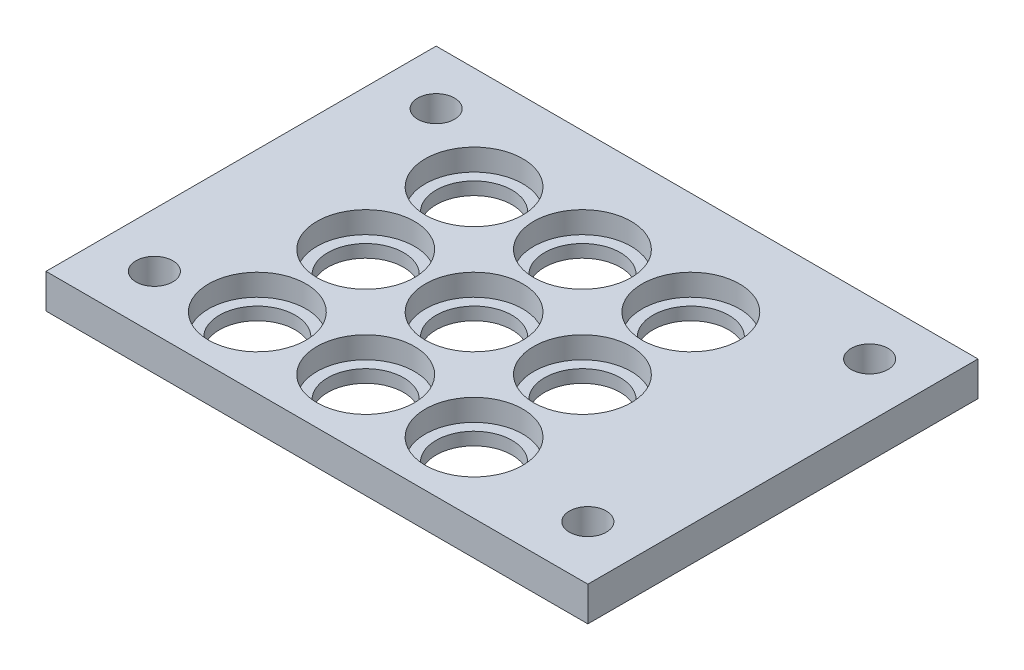
ISO-10303-21;
HEADER;
FILE_DESCRIPTION(('STEP AP214'),'2;1');
FILE_NAME('part.step','',(''),(''),'','','');
FILE_SCHEMA(('AUTOMOTIVE_DESIGN { 1 0 10303 214 1 1 1 1 }'));
ENDSEC;
DATA;
#1=APPLICATION_CONTEXT('core data for automotive mechanical design processes');
#2=APPLICATION_PROTOCOL_DEFINITION('international standard','automotive_design',2000,#1);
#3=PRODUCT_CONTEXT('',#1,'mechanical');
#4=PRODUCT('Part','Part','',(#3));
#5=PRODUCT_RELATED_PRODUCT_CATEGORY('part','',(#4));
#6=PRODUCT_DEFINITION_FORMATION('','',#4);
#7=PRODUCT_DEFINITION_CONTEXT('part definition',#1,'design');
#8=PRODUCT_DEFINITION('design','',#6,#7);
#9=PRODUCT_DEFINITION_SHAPE('','',#8);
#10=(LENGTH_UNIT() NAMED_UNIT(*) SI_UNIT(.MILLI.,.METRE.));
#11=(NAMED_UNIT(*) PLANE_ANGLE_UNIT() SI_UNIT($,.RADIAN.));
#12=(NAMED_UNIT(*) SI_UNIT($,.STERADIAN.) SOLID_ANGLE_UNIT());
#13=UNCERTAINTY_MEASURE_WITH_UNIT(LENGTH_MEASURE(1.E-05),#10,'distance_accuracy_value','');
#14=(GEOMETRIC_REPRESENTATION_CONTEXT(3) GLOBAL_UNCERTAINTY_ASSIGNED_CONTEXT((#13)) GLOBAL_UNIT_ASSIGNED_CONTEXT((#10,
#11,#12)) REPRESENTATION_CONTEXT('',''));
#15=CARTESIAN_POINT('',(0.,0.,0.));
#16=DIRECTION('',(0.,0.,1.));
#17=DIRECTION('',(1.,0.,0.));
#18=AXIS2_PLACEMENT_3D('',#15,#16,#17);
#19=CARTESIAN_POINT('',(13.,3.175,-6.5));
#20=DIRECTION('',(0.,-1.,0.));
#21=DIRECTION('',(0.,0.,-1.));
#22=AXIS2_PLACEMENT_3D('',#19,#20,#21);
#23=CYLINDRICAL_SURFACE('',#22,3.5);
#24=CARTESIAN_POINT('',(13.,0.,-6.5));
#25=DIRECTION('',(0.,1.,0.));
#26=DIRECTION('',(0.,0.,1.));
#27=AXIS2_PLACEMENT_3D('',#24,#25,#26);
#28=CIRCLE('',#27,3.5);
#29=CARTESIAN_POINT('',(13.,0.,-3.));
#30=VERTEX_POINT('',#29);
#31=EDGE_CURVE('E168',#30,#30,#28,.T.);
#32=ORIENTED_EDGE('',*,*,#31,.F.);
#33=EDGE_LOOP('',(#32));
#34=FACE_BOUND('',#33,.T.);
#35=CARTESIAN_POINT('',(13.,1.175,-6.5));
#36=DIRECTION('',(0.,1.,0.));
#37=DIRECTION('',(0.,0.,1.));
#38=AXIS2_PLACEMENT_3D('',#35,#36,#37);
#39=CIRCLE('',#38,3.5);
#40=CARTESIAN_POINT('',(13.,1.175,-3.));
#41=VERTEX_POINT('',#40);
#42=EDGE_CURVE('E52',#41,#41,#39,.T.);
#43=ORIENTED_EDGE('',*,*,#42,.T.);
#44=EDGE_LOOP('',(#43));
#45=FACE_BOUND('',#44,.T.);
#46=ADVANCED_FACE('F48',(#34,#45),#23,.F.);
#47=CARTESIAN_POINT('',(23.,3.175,-6.5));
#48=DIRECTION('',(0.,-1.,0.));
#49=DIRECTION('',(0.,0.,-1.));
#50=AXIS2_PLACEMENT_3D('',#47,#48,#49);
#51=CYLINDRICAL_SURFACE('',#50,3.5);
#52=CARTESIAN_POINT('',(23.,0.,-6.5));
#53=DIRECTION('',(0.,1.,0.));
#54=DIRECTION('',(0.,0.,1.));
#55=AXIS2_PLACEMENT_3D('',#52,#53,#54);
#56=CIRCLE('',#55,3.5);
#57=CARTESIAN_POINT('',(23.,0.,-3.));
#58=VERTEX_POINT('',#57);
#59=EDGE_CURVE('E148',#58,#58,#56,.T.);
#60=ORIENTED_EDGE('',*,*,#59,.F.);
#61=EDGE_LOOP('',(#60));
#62=FACE_BOUND('',#61,.T.);
#63=CARTESIAN_POINT('',(23.,1.175,-6.5));
#64=DIRECTION('',(0.,1.,0.));
#65=DIRECTION('',(0.,0.,1.));
#66=AXIS2_PLACEMENT_3D('',#63,#64,#65);
#67=CIRCLE('',#66,3.5);
#68=CARTESIAN_POINT('',(23.,1.175,-3.));
#69=VERTEX_POINT('',#68);
#70=EDGE_CURVE('E217',#69,#69,#67,.T.);
#71=ORIENTED_EDGE('',*,*,#70,.T.);
#72=EDGE_LOOP('',(#71));
#73=FACE_BOUND('',#72,.T.);
#74=ADVANCED_FACE('F326',(#62,#73),#51,.F.);
#75=CARTESIAN_POINT('',(33.,3.175,-6.5));
#76=DIRECTION('',(0.,-1.,0.));
#77=DIRECTION('',(0.,0.,-1.));
#78=AXIS2_PLACEMENT_3D('',#75,#76,#77);
#79=CYLINDRICAL_SURFACE('',#78,3.5);
#80=CARTESIAN_POINT('',(33.,0.,-6.5));
#81=DIRECTION('',(0.,1.,0.));
#82=DIRECTION('',(0.,0.,1.));
#83=AXIS2_PLACEMENT_3D('',#80,#81,#82);
#84=CIRCLE('',#83,3.5);
#85=CARTESIAN_POINT('',(33.,0.,-3.));
#86=VERTEX_POINT('',#85);
#87=EDGE_CURVE('E144',#86,#86,#84,.T.);
#88=ORIENTED_EDGE('',*,*,#87,.F.);
#89=EDGE_LOOP('',(#88));
#90=FACE_BOUND('',#89,.T.);
#91=CARTESIAN_POINT('',(33.,1.175,-6.5));
#92=DIRECTION('',(0.,1.,0.));
#93=DIRECTION('',(0.,0.,1.));
#94=AXIS2_PLACEMENT_3D('',#91,#92,#93);
#95=CIRCLE('',#94,3.5);
#96=CARTESIAN_POINT('',(33.,1.175,-3.));
#97=VERTEX_POINT('',#96);
#98=EDGE_CURVE('E214',#97,#97,#95,.T.);
#99=ORIENTED_EDGE('',*,*,#98,.T.);
#100=EDGE_LOOP('',(#99));
#101=FACE_BOUND('',#100,.T.);
#102=ADVANCED_FACE('F332',(#90,#101),#79,.F.);
#103=CARTESIAN_POINT('',(23.,3.175,-16.5));
#104=DIRECTION('',(0.,-1.,0.));
#105=DIRECTION('',(0.,0.,-1.));
#106=AXIS2_PLACEMENT_3D('',#103,#104,#105);
#107=CYLINDRICAL_SURFACE('',#106,3.5);
#108=CARTESIAN_POINT('',(23.,0.,-16.5));
#109=DIRECTION('',(0.,1.,0.));
#110=DIRECTION('',(0.,0.,1.));
#111=AXIS2_PLACEMENT_3D('',#108,#109,#110);
#112=CIRCLE('',#111,3.5);
#113=CARTESIAN_POINT('',(23.,0.,-13.));
#114=VERTEX_POINT('',#113);
#115=EDGE_CURVE('E140',#114,#114,#112,.T.);
#116=ORIENTED_EDGE('',*,*,#115,.F.);
#117=EDGE_LOOP('',(#116));
#118=FACE_BOUND('',#117,.T.);
#119=CARTESIAN_POINT('',(23.,1.175,-16.5));
#120=DIRECTION('',(0.,1.,0.));
#121=DIRECTION('',(0.,0.,1.));
#122=AXIS2_PLACEMENT_3D('',#119,#120,#121);
#123=CIRCLE('',#122,3.5);
#124=CARTESIAN_POINT('',(23.,1.175,-13.));
#125=VERTEX_POINT('',#124);
#126=EDGE_CURVE('E210',#125,#125,#123,.T.);
#127=ORIENTED_EDGE('',*,*,#126,.T.);
#128=EDGE_LOOP('',(#127));
#129=FACE_BOUND('',#128,.T.);
#130=ADVANCED_FACE('F355',(#118,#129),#107,.F.);
#131=CARTESIAN_POINT('',(33.,3.175,-16.5));
#132=DIRECTION('',(0.,-1.,0.));
#133=DIRECTION('',(0.,0.,-1.));
#134=AXIS2_PLACEMENT_3D('',#131,#132,#133);
#135=CYLINDRICAL_SURFACE('',#134,3.5);
#136=CARTESIAN_POINT('',(33.,0.,-16.5));
#137=DIRECTION('',(0.,1.,0.));
#138=DIRECTION('',(0.,0.,1.));
#139=AXIS2_PLACEMENT_3D('',#136,#137,#138);
#140=CIRCLE('',#139,3.5);
#141=CARTESIAN_POINT('',(33.,0.,-13.));
#142=VERTEX_POINT('',#141);
#143=EDGE_CURVE('E136',#142,#142,#140,.T.);
#144=ORIENTED_EDGE('',*,*,#143,.F.);
#145=EDGE_LOOP('',(#144));
#146=FACE_BOUND('',#145,.T.);
#147=CARTESIAN_POINT('',(33.,1.175,-16.5));
#148=DIRECTION('',(0.,1.,0.));
#149=DIRECTION('',(0.,0.,1.));
#150=AXIS2_PLACEMENT_3D('',#147,#148,#149);
#151=CIRCLE('',#150,3.5);
#152=CARTESIAN_POINT('',(33.,1.175,-13.));
#153=VERTEX_POINT('',#152);
#154=EDGE_CURVE('E206',#153,#153,#151,.T.);
#155=ORIENTED_EDGE('',*,*,#154,.T.);
#156=EDGE_LOOP('',(#155));
#157=FACE_BOUND('',#156,.T.);
#158=ADVANCED_FACE('F359',(#146,#157),#135,.F.);
#159=CARTESIAN_POINT('',(22.9999999999999,3.175,-26.5));
#160=DIRECTION('',(0.,-1.,0.));
#161=DIRECTION('',(0.,0.,-1.));
#162=AXIS2_PLACEMENT_3D('',#159,#160,#161);
#163=CYLINDRICAL_SURFACE('',#162,3.5);
#164=CARTESIAN_POINT('',(22.9999999999999,0.,-26.5));
#165=DIRECTION('',(0.,1.,0.));
#166=DIRECTION('',(0.,0.,1.));
#167=AXIS2_PLACEMENT_3D('',#164,#165,#166);
#168=CIRCLE('',#167,3.5);
#169=CARTESIAN_POINT('',(22.9999999999999,0.,-23.));
#170=VERTEX_POINT('',#169);
#171=EDGE_CURVE('E132',#170,#170,#168,.T.);
#172=ORIENTED_EDGE('',*,*,#171,.F.);
#173=EDGE_LOOP('',(#172));
#174=FACE_BOUND('',#173,.T.);
#175=CARTESIAN_POINT('',(22.9999999999999,1.175,-26.5));
#176=DIRECTION('',(0.,1.,0.));
#177=DIRECTION('',(0.,0.,1.));
#178=AXIS2_PLACEMENT_3D('',#175,#176,#177);
#179=CIRCLE('',#178,3.5);
#180=CARTESIAN_POINT('',(22.9999999999999,1.175,-23.));
#181=VERTEX_POINT('',#180);
#182=EDGE_CURVE('E202',#181,#181,#179,.T.);
#183=ORIENTED_EDGE('',*,*,#182,.T.);
#184=EDGE_LOOP('',(#183));
#185=FACE_BOUND('',#184,.T.);
#186=ADVANCED_FACE('F363',(#174,#185),#163,.F.);
#187=CARTESIAN_POINT('',(32.9999999999999,3.175,-26.5));
#188=DIRECTION('',(0.,-1.,0.));
#189=DIRECTION('',(0.,0.,-1.));
#190=AXIS2_PLACEMENT_3D('',#187,#188,#189);
#191=CYLINDRICAL_SURFACE('',#190,3.5);
#192=CARTESIAN_POINT('',(32.9999999999999,0.,-26.5));
#193=DIRECTION('',(0.,1.,0.));
#194=DIRECTION('',(0.,0.,1.));
#195=AXIS2_PLACEMENT_3D('',#192,#193,#194);
#196=CIRCLE('',#195,3.5);
#197=CARTESIAN_POINT('',(32.9999999999999,0.,-23.));
#198=VERTEX_POINT('',#197);
#199=EDGE_CURVE('E128',#198,#198,#196,.T.);
#200=ORIENTED_EDGE('',*,*,#199,.F.);
#201=EDGE_LOOP('',(#200));
#202=FACE_BOUND('',#201,.T.);
#203=CARTESIAN_POINT('',(32.9999999999999,1.175,-26.5));
#204=DIRECTION('',(0.,1.,0.));
#205=DIRECTION('',(0.,0.,1.));
#206=AXIS2_PLACEMENT_3D('',#203,#204,#205);
#207=CIRCLE('',#206,3.5);
#208=CARTESIAN_POINT('',(32.9999999999999,1.175,-23.));
#209=VERTEX_POINT('',#208);
#210=EDGE_CURVE('E198',#209,#209,#207,.T.);
#211=ORIENTED_EDGE('',*,*,#210,.T.);
#212=EDGE_LOOP('',(#211));
#213=FACE_BOUND('',#212,.T.);
#214=ADVANCED_FACE('F367',(#202,#213),#191,.F.);
#215=CARTESIAN_POINT('',(13.,3.175,-16.5));
#216=DIRECTION('',(0.,-1.,0.));
#217=DIRECTION('',(0.,0.,-1.));
#218=AXIS2_PLACEMENT_3D('',#215,#216,#217);
#219=CYLINDRICAL_SURFACE('',#218,3.5);
#220=CARTESIAN_POINT('',(13.,0.,-16.5));
#221=DIRECTION('',(0.,1.,0.));
#222=DIRECTION('',(0.,0.,1.));
#223=AXIS2_PLACEMENT_3D('',#220,#221,#222);
#224=CIRCLE('',#223,3.5);
#225=CARTESIAN_POINT('',(13.,0.,-13.));
#226=VERTEX_POINT('',#225);
#227=EDGE_CURVE('E124',#226,#226,#224,.T.);
#228=ORIENTED_EDGE('',*,*,#227,.F.);
#229=EDGE_LOOP('',(#228));
#230=FACE_BOUND('',#229,.T.);
#231=CARTESIAN_POINT('',(13.,1.175,-16.5));
#232=DIRECTION('',(0.,1.,0.));
#233=DIRECTION('',(0.,0.,1.));
#234=AXIS2_PLACEMENT_3D('',#231,#232,#233);
#235=CIRCLE('',#234,3.5);
#236=CARTESIAN_POINT('',(13.,1.175,-13.));
#237=VERTEX_POINT('',#236);
#238=EDGE_CURVE('E193',#237,#237,#235,.T.);
#239=ORIENTED_EDGE('',*,*,#238,.T.);
#240=EDGE_LOOP('',(#239));
#241=FACE_BOUND('',#240,.T.);
#242=ADVANCED_FACE('F370',(#230,#241),#219,.F.);
#243=CARTESIAN_POINT('',(12.9999999999999,3.175,-26.5));
#244=DIRECTION('',(0.,-1.,0.));
#245=DIRECTION('',(0.,0.,-1.));
#246=AXIS2_PLACEMENT_3D('',#243,#244,#245);
#247=CYLINDRICAL_SURFACE('',#246,3.5);
#248=CARTESIAN_POINT('',(12.9999999999999,0.,-26.5));
#249=DIRECTION('',(0.,1.,0.));
#250=DIRECTION('',(0.,0.,1.));
#251=AXIS2_PLACEMENT_3D('',#248,#249,#250);
#252=CIRCLE('',#251,3.5);
#253=CARTESIAN_POINT('',(12.9999999999999,0.,-23.));
#254=VERTEX_POINT('',#253);
#255=EDGE_CURVE('E120',#254,#254,#252,.T.);
#256=ORIENTED_EDGE('',*,*,#255,.F.);
#257=EDGE_LOOP('',(#256));
#258=FACE_BOUND('',#257,.T.);
#259=CARTESIAN_POINT('',(12.9999999999999,1.175,-26.5));
#260=DIRECTION('',(0.,1.,0.));
#261=DIRECTION('',(0.,0.,1.));
#262=AXIS2_PLACEMENT_3D('',#259,#260,#261);
#263=CIRCLE('',#262,3.5);
#264=CARTESIAN_POINT('',(12.9999999999999,1.175,-23.));
#265=VERTEX_POINT('',#264);
#266=EDGE_CURVE('E189',#265,#265,#263,.T.);
#267=ORIENTED_EDGE('',*,*,#266,.T.);
#268=EDGE_LOOP('',(#267));
#269=FACE_BOUND('',#268,.T.);
#270=ADVANCED_FACE('F50',(#258,#269),#247,.F.);
#271=CARTESIAN_POINT('',(0.,3.175,0.));
#272=DIRECTION('',(0.,0.,-1.));
#273=DIRECTION('',(-1.,0.,0.));
#274=AXIS2_PLACEMENT_3D('',#271,#272,#273);
#275=PLANE('',#274);
#276=DIRECTION('',(1.,0.,0.));
#277=VECTOR('',#276,1.);
#278=CARTESIAN_POINT('',(0.,0.,0.));
#279=LINE('',#278,#277);
#280=CARTESIAN_POINT('',(0.,0.,0.));
#281=VERTEX_POINT('',#280);
#282=CARTESIAN_POINT('',(50.,0.,0.));
#283=VERTEX_POINT('',#282);
#284=EDGE_CURVE('E172',#281,#283,#279,.T.);
#285=ORIENTED_EDGE('',*,*,#284,.T.);
#286=DIRECTION('',(0.,-1.,0.));
#287=VECTOR('',#286,1.);
#288=CARTESIAN_POINT('',(50.,3.175,0.));
#289=LINE('',#288,#287);
#290=CARTESIAN_POINT('',(50.,3.175,0.));
#291=VERTEX_POINT('',#290);
#292=EDGE_CURVE('E12',#291,#283,#289,.T.);
#293=ORIENTED_EDGE('',*,*,#292,.F.);
#294=DIRECTION('',(1.,0.,0.));
#295=VECTOR('',#294,1.);
#296=CARTESIAN_POINT('',(0.,3.175,0.));
#297=LINE('',#296,#295);
#298=CARTESIAN_POINT('',(0.,3.175,0.));
#299=VERTEX_POINT('',#298);
#300=EDGE_CURVE('E101',#299,#291,#297,.T.);
#301=ORIENTED_EDGE('',*,*,#300,.F.);
#302=DIRECTION('',(0.,-1.,0.));
#303=VECTOR('',#302,1.);
#304=CARTESIAN_POINT('',(0.,3.175,0.));
#305=LINE('',#304,#303);
#306=EDGE_CURVE('E68',#299,#281,#305,.T.);
#307=ORIENTED_EDGE('',*,*,#306,.T.);
#308=EDGE_LOOP('',(#285,#293,#301,#307));
#309=FACE_BOUND('',#308,.T.);
#310=ADVANCED_FACE('F338',(#309),#275,.F.);
#311=CARTESIAN_POINT('',(50.,3.175,0.));
#312=DIRECTION('',(-1.,0.,0.));
#313=DIRECTION('',(0.,0.,1.));
#314=AXIS2_PLACEMENT_3D('',#311,#312,#313);
#315=PLANE('',#314);
#316=DIRECTION('',(0.,0.,-1.));
#317=VECTOR('',#316,1.);
#318=CARTESIAN_POINT('',(50.,0.,0.));
#319=LINE('',#318,#317);
#320=CARTESIAN_POINT('',(50.,0.,-36.));
#321=VERTEX_POINT('',#320);
#322=EDGE_CURVE('E107',#283,#321,#319,.T.);
#323=ORIENTED_EDGE('',*,*,#322,.T.);
#324=DIRECTION('',(0.,-1.,0.));
#325=VECTOR('',#324,1.);
#326=CARTESIAN_POINT('',(50.,3.175,-36.));
#327=LINE('',#326,#325);
#328=CARTESIAN_POINT('',(50.,3.175,-36.));
#329=VERTEX_POINT('',#328);
#330=EDGE_CURVE('E59',#329,#321,#327,.T.);
#331=ORIENTED_EDGE('',*,*,#330,.F.);
#332=DIRECTION('',(0.,0.,-1.));
#333=VECTOR('',#332,1.);
#334=CARTESIAN_POINT('',(50.,3.175,0.));
#335=LINE('',#334,#333);
#336=EDGE_CURVE('E93',#291,#329,#335,.T.);
#337=ORIENTED_EDGE('',*,*,#336,.F.);
#338=ORIENTED_EDGE('',*,*,#292,.T.);
#339=EDGE_LOOP('',(#323,#331,#337,#338));
#340=FACE_BOUND('',#339,.T.);
#341=ADVANCED_FACE('F106',(#340),#315,.F.);
#342=CARTESIAN_POINT('',(0.,3.175,-36.));
#343=DIRECTION('',(0.,0.,-1.));
#344=DIRECTION('',(-1.,0.,0.));
#345=AXIS2_PLACEMENT_3D('',#342,#343,#344);
#346=PLANE('',#345);
#347=DIRECTION('',(1.,0.,0.));
#348=VECTOR('',#347,1.);
#349=CARTESIAN_POINT('',(0.,0.,-36.));
#350=LINE('',#349,#348);
#351=CARTESIAN_POINT('',(0.,0.,-36.));
#352=VERTEX_POINT('',#351);
#353=EDGE_CURVE('E177',#352,#321,#350,.T.);
#354=ORIENTED_EDGE('',*,*,#353,.F.);
#355=DIRECTION('',(0.,-1.,0.));
#356=VECTOR('',#355,1.);
#357=CARTESIAN_POINT('',(0.,3.175,-36.));
#358=LINE('',#357,#356);
#359=CARTESIAN_POINT('',(0.,3.175,-36.));
#360=VERTEX_POINT('',#359);
#361=EDGE_CURVE('E82',#360,#352,#358,.T.);
#362=ORIENTED_EDGE('',*,*,#361,.F.);
#363=DIRECTION('',(1.,0.,0.));
#364=VECTOR('',#363,1.);
#365=CARTESIAN_POINT('',(0.,3.175,-36.));
#366=LINE('',#365,#364);
#367=EDGE_CURVE('E100',#360,#329,#366,.T.);
#368=ORIENTED_EDGE('',*,*,#367,.T.);
#369=ORIENTED_EDGE('',*,*,#330,.T.);
#370=EDGE_LOOP('',(#354,#362,#368,#369));
#371=FACE_BOUND('',#370,.T.);
#372=ADVANCED_FACE('F112',(#371),#346,.T.);
#373=CARTESIAN_POINT('',(5.,3.175,-5.));
#374=DIRECTION('',(0.,-1.,0.));
#375=DIRECTION('',(0.,0.,-1.));
#376=AXIS2_PLACEMENT_3D('',#373,#374,#375);
#377=CYLINDRICAL_SURFACE('',#376,1.7);
#378=CARTESIAN_POINT('',(5.,3.175,-5.));
#379=DIRECTION('',(0.,1.,0.));
#380=DIRECTION('',(0.,0.,1.));
#381=AXIS2_PLACEMENT_3D('',#378,#379,#380);
#382=CIRCLE('',#381,1.7);
#383=CARTESIAN_POINT('',(5.,3.175,-3.3));
#384=VERTEX_POINT('',#383);
#385=EDGE_CURVE('E297',#384,#384,#382,.T.);
#386=ORIENTED_EDGE('',*,*,#385,.T.);
#387=EDGE_LOOP('',(#386));
#388=FACE_BOUND('',#387,.T.);
#389=CARTESIAN_POINT('',(5.,0.,-5.));
#390=DIRECTION('',(0.,1.,0.));
#391=DIRECTION('',(0.,0.,1.));
#392=AXIS2_PLACEMENT_3D('',#389,#390,#391);
#393=CIRCLE('',#392,1.7);
#394=CARTESIAN_POINT('',(5.,0.,-3.3));
#395=VERTEX_POINT('',#394);
#396=EDGE_CURVE('E164',#395,#395,#393,.T.);
#397=ORIENTED_EDGE('',*,*,#396,.F.);
#398=EDGE_LOOP('',(#397));
#399=FACE_BOUND('',#398,.T.);
#400=ADVANCED_FACE('F303',(#388,#399),#377,.F.);
#401=CARTESIAN_POINT('',(5.,3.175,-31.));
#402=DIRECTION('',(0.,-1.,0.));
#403=DIRECTION('',(0.,0.,-1.));
#404=AXIS2_PLACEMENT_3D('',#401,#402,#403);
#405=CYLINDRICAL_SURFACE('',#404,1.7);
#406=CARTESIAN_POINT('',(5.,3.175,-31.));
#407=DIRECTION('',(0.,1.,0.));
#408=DIRECTION('',(0.,0.,1.));
#409=AXIS2_PLACEMENT_3D('',#406,#407,#408);
#410=CIRCLE('',#409,1.7);
#411=CARTESIAN_POINT('',(5.,3.175,-29.3));
#412=VERTEX_POINT('',#411);
#413=EDGE_CURVE('E293',#412,#412,#410,.T.);
#414=ORIENTED_EDGE('',*,*,#413,.T.);
#415=EDGE_LOOP('',(#414));
#416=FACE_BOUND('',#415,.T.);
#417=CARTESIAN_POINT('',(5.,0.,-31.));
#418=DIRECTION('',(0.,1.,0.));
#419=DIRECTION('',(0.,0.,1.));
#420=AXIS2_PLACEMENT_3D('',#417,#418,#419);
#421=CIRCLE('',#420,1.7);
#422=CARTESIAN_POINT('',(5.,0.,-29.3));
#423=VERTEX_POINT('',#422);
#424=EDGE_CURVE('E160',#423,#423,#421,.T.);
#425=ORIENTED_EDGE('',*,*,#424,.F.);
#426=EDGE_LOOP('',(#425));
#427=FACE_BOUND('',#426,.T.);
#428=ADVANCED_FACE('F342',(#416,#427),#405,.F.);
#429=CARTESIAN_POINT('',(45.,3.175,-31.));
#430=DIRECTION('',(0.,-1.,0.));
#431=DIRECTION('',(0.,0.,-1.));
#432=AXIS2_PLACEMENT_3D('',#429,#430,#431);
#433=CYLINDRICAL_SURFACE('',#432,1.7);
#434=CARTESIAN_POINT('',(45.,3.175,-31.));
#435=DIRECTION('',(0.,1.,0.));
#436=DIRECTION('',(0.,0.,1.));
#437=AXIS2_PLACEMENT_3D('',#434,#435,#436);
#438=CIRCLE('',#437,1.7);
#439=CARTESIAN_POINT('',(45.,3.175,-29.3));
#440=VERTEX_POINT('',#439);
#441=EDGE_CURVE('E289',#440,#440,#438,.T.);
#442=ORIENTED_EDGE('',*,*,#441,.T.);
#443=EDGE_LOOP('',(#442));
#444=FACE_BOUND('',#443,.T.);
#445=CARTESIAN_POINT('',(45.,0.,-31.));
#446=DIRECTION('',(0.,1.,0.));
#447=DIRECTION('',(0.,0.,1.));
#448=AXIS2_PLACEMENT_3D('',#445,#446,#447);
#449=CIRCLE('',#448,1.7);
#450=CARTESIAN_POINT('',(45.,0.,-29.3));
#451=VERTEX_POINT('',#450);
#452=EDGE_CURVE('E156',#451,#451,#449,.T.);
#453=ORIENTED_EDGE('',*,*,#452,.F.);
#454=EDGE_LOOP('',(#453));
#455=FACE_BOUND('',#454,.T.);
#456=ADVANCED_FACE('F345',(#444,#455),#433,.F.);
#457=CARTESIAN_POINT('',(45.,3.175,-5.));
#458=DIRECTION('',(0.,-1.,0.));
#459=DIRECTION('',(0.,0.,-1.));
#460=AXIS2_PLACEMENT_3D('',#457,#458,#459);
#461=CYLINDRICAL_SURFACE('',#460,1.7);
#462=CARTESIAN_POINT('',(45.,3.175,-5.));
#463=DIRECTION('',(0.,1.,0.));
#464=DIRECTION('',(0.,0.,1.));
#465=AXIS2_PLACEMENT_3D('',#462,#463,#464);
#466=CIRCLE('',#465,1.7);
#467=CARTESIAN_POINT('',(45.,3.175,-3.3));
#468=VERTEX_POINT('',#467);
#469=EDGE_CURVE('E184',#468,#468,#466,.T.);
#470=ORIENTED_EDGE('',*,*,#469,.T.);
#471=EDGE_LOOP('',(#470));
#472=FACE_BOUND('',#471,.T.);
#473=CARTESIAN_POINT('',(45.,0.,-5.));
#474=DIRECTION('',(0.,1.,0.));
#475=DIRECTION('',(0.,0.,1.));
#476=AXIS2_PLACEMENT_3D('',#473,#474,#475);
#477=CIRCLE('',#476,1.7);
#478=CARTESIAN_POINT('',(45.,0.,-3.3));
#479=VERTEX_POINT('',#478);
#480=EDGE_CURVE('E152',#479,#479,#477,.T.);
#481=ORIENTED_EDGE('',*,*,#480,.F.);
#482=EDGE_LOOP('',(#481));
#483=FACE_BOUND('',#482,.T.);
#484=ADVANCED_FACE('F320',(#472,#483),#461,.F.);
#485=CARTESIAN_POINT('',(0.,3.175,0.));
#486=DIRECTION('',(-1.,0.,0.));
#487=DIRECTION('',(0.,0.,1.));
#488=AXIS2_PLACEMENT_3D('',#485,#486,#487);
#489=PLANE('',#488);
#490=DIRECTION('',(0.,0.,-1.));
#491=VECTOR('',#490,1.);
#492=CARTESIAN_POINT('',(0.,0.,0.));
#493=LINE('',#492,#491);
#494=EDGE_CURVE('E180',#281,#352,#493,.T.);
#495=ORIENTED_EDGE('',*,*,#494,.F.);
#496=ORIENTED_EDGE('',*,*,#306,.F.);
#497=DIRECTION('',(0.,0.,-1.));
#498=VECTOR('',#497,1.);
#499=CARTESIAN_POINT('',(0.,3.175,0.));
#500=LINE('',#499,#498);
#501=EDGE_CURVE('E114',#299,#360,#500,.T.);
#502=ORIENTED_EDGE('',*,*,#501,.T.);
#503=ORIENTED_EDGE('',*,*,#361,.T.);
#504=EDGE_LOOP('',(#495,#496,#502,#503));
#505=FACE_BOUND('',#504,.T.);
#506=ADVANCED_FACE('F308',(#505),#489,.T.);
#507=CARTESIAN_POINT('',(0.,3.175,0.));
#508=DIRECTION('',(0.,1.,0.));
#509=DIRECTION('',(0.,0.,1.));
#510=AXIS2_PLACEMENT_3D('',#507,#508,#509);
#511=PLANE('',#510);
#512=CARTESIAN_POINT('',(22.9999999999999,3.175,-26.5));
#513=DIRECTION('',(0.,1.,0.));
#514=DIRECTION('',(0.,0.,1.));
#515=AXIS2_PLACEMENT_3D('',#512,#513,#514);
#516=CIRCLE('',#515,4.5);
#517=CARTESIAN_POINT('',(22.9999999999999,3.175,-22.));
#518=VERTEX_POINT('',#517);
#519=EDGE_CURVE('E246',#518,#518,#516,.T.);
#520=ORIENTED_EDGE('',*,*,#519,.F.);
#521=EDGE_LOOP('',(#520));
#522=FACE_BOUND('',#521,.T.);
#523=CARTESIAN_POINT('',(32.9999999999999,3.175,-26.5));
#524=DIRECTION('',(0.,1.,0.));
#525=DIRECTION('',(0.,0.,1.));
#526=AXIS2_PLACEMENT_3D('',#523,#524,#525);
#527=CIRCLE('',#526,4.5);
#528=CARTESIAN_POINT('',(32.9999999999999,3.175,-22.));
#529=VERTEX_POINT('',#528);
#530=EDGE_CURVE('E255',#529,#529,#527,.T.);
#531=ORIENTED_EDGE('',*,*,#530,.F.);
#532=EDGE_LOOP('',(#531));
#533=FACE_BOUND('',#532,.T.);
#534=CARTESIAN_POINT('',(23.,3.175,-16.5));
#535=DIRECTION('',(0.,1.,0.));
#536=DIRECTION('',(0.,0.,1.));
#537=AXIS2_PLACEMENT_3D('',#534,#535,#536);
#538=CIRCLE('',#537,4.5);
#539=CARTESIAN_POINT('',(23.,3.175,-12.));
#540=VERTEX_POINT('',#539);
#541=EDGE_CURVE('E263',#540,#540,#538,.T.);
#542=ORIENTED_EDGE('',*,*,#541,.F.);
#543=EDGE_LOOP('',(#542));
#544=FACE_BOUND('',#543,.T.);
#545=CARTESIAN_POINT('',(33.,3.175,-16.5));
#546=DIRECTION('',(0.,1.,0.));
#547=DIRECTION('',(0.,0.,1.));
#548=AXIS2_PLACEMENT_3D('',#545,#546,#547);
#549=CIRCLE('',#548,4.5);
#550=CARTESIAN_POINT('',(33.,3.175,-12.));
#551=VERTEX_POINT('',#550);
#552=EDGE_CURVE('E271',#551,#551,#549,.T.);
#553=ORIENTED_EDGE('',*,*,#552,.F.);
#554=EDGE_LOOP('',(#553));
#555=FACE_BOUND('',#554,.T.);
#556=CARTESIAN_POINT('',(23.0000000000001,3.175,-6.49999999999999));
#557=DIRECTION('',(0.,1.,0.));
#558=DIRECTION('',(0.,0.,1.));
#559=AXIS2_PLACEMENT_3D('',#556,#557,#558);
#560=CIRCLE('',#559,4.5);
#561=CARTESIAN_POINT('',(23.0000000000001,3.175,-1.99999999999999));
#562=VERTEX_POINT('',#561);
#563=EDGE_CURVE('E279',#562,#562,#560,.T.);
#564=ORIENTED_EDGE('',*,*,#563,.F.);
#565=EDGE_LOOP('',(#564));
#566=FACE_BOUND('',#565,.T.);
#567=CARTESIAN_POINT('',(33.0000000000001,3.175,-6.49999999999999));
#568=DIRECTION('',(0.,1.,0.));
#569=DIRECTION('',(0.,0.,1.));
#570=AXIS2_PLACEMENT_3D('',#567,#568,#569);
#571=CIRCLE('',#570,4.5);
#572=CARTESIAN_POINT('',(33.0000000000001,3.175,-1.99999999999999));
#573=VERTEX_POINT('',#572);
#574=EDGE_CURVE('E399',#573,#573,#571,.T.);
#575=ORIENTED_EDGE('',*,*,#574,.F.);
#576=EDGE_LOOP('',(#575));
#577=FACE_BOUND('',#576,.T.);
#578=CARTESIAN_POINT('',(13.,3.175,-16.5));
#579=DIRECTION('',(0.,1.,0.));
#580=DIRECTION('',(0.,0.,1.));
#581=AXIS2_PLACEMENT_3D('',#578,#579,#580);
#582=CIRCLE('',#581,4.5);
#583=CARTESIAN_POINT('',(13.,3.175,-12.));
#584=VERTEX_POINT('',#583);
#585=EDGE_CURVE('E390',#584,#584,#582,.T.);
#586=ORIENTED_EDGE('',*,*,#585,.F.);
#587=EDGE_LOOP('',(#586));
#588=FACE_BOUND('',#587,.T.);
#589=CARTESIAN_POINT('',(13.0000000000001,3.175,-6.49999999999999));
#590=DIRECTION('',(0.,1.,0.));
#591=DIRECTION('',(0.,0.,1.));
#592=AXIS2_PLACEMENT_3D('',#589,#590,#591);
#593=CIRCLE('',#592,4.5);
#594=CARTESIAN_POINT('',(13.0000000000001,3.175,-1.99999999999999));
#595=VERTEX_POINT('',#594);
#596=EDGE_CURVE('E238',#595,#595,#593,.T.);
#597=ORIENTED_EDGE('',*,*,#596,.F.);
#598=EDGE_LOOP('',(#597));
#599=FACE_BOUND('',#598,.T.);
#600=CARTESIAN_POINT('',(12.9999999999999,3.175,-26.5));
#601=DIRECTION('',(0.,1.,0.));
#602=DIRECTION('',(0.,0.,1.));
#603=AXIS2_PLACEMENT_3D('',#600,#601,#602);
#604=CIRCLE('',#603,4.5);
#605=CARTESIAN_POINT('',(12.9999999999999,3.175,-22.));
#606=VERTEX_POINT('',#605);
#607=EDGE_CURVE('E250',#606,#606,#604,.T.);
#608=ORIENTED_EDGE('',*,*,#607,.F.);
#609=EDGE_LOOP('',(#608));
#610=FACE_BOUND('',#609,.T.);
#611=ORIENTED_EDGE('',*,*,#469,.F.);
#612=EDGE_LOOP('',(#611));
#613=FACE_BOUND('',#612,.T.);
#614=ORIENTED_EDGE('',*,*,#441,.F.);
#615=EDGE_LOOP('',(#614));
#616=FACE_BOUND('',#615,.T.);
#617=ORIENTED_EDGE('',*,*,#413,.F.);
#618=EDGE_LOOP('',(#617));
#619=FACE_BOUND('',#618,.T.);
#620=ORIENTED_EDGE('',*,*,#385,.F.);
#621=EDGE_LOOP('',(#620));
#622=FACE_BOUND('',#621,.T.);
#623=ORIENTED_EDGE('',*,*,#300,.T.);
#624=ORIENTED_EDGE('',*,*,#336,.T.);
#625=ORIENTED_EDGE('',*,*,#367,.F.);
#626=ORIENTED_EDGE('',*,*,#501,.F.);
#627=EDGE_LOOP('',(#623,#624,#625,#626));
#628=FACE_BOUND('',#627,.T.);
#629=ADVANCED_FACE('F97',(#522,#533,#544,#555,#566,#577,#588,#599,#610,#613,#616,#619,#622,
#628),#511,.T.);
#630=CARTESIAN_POINT('',(0.,0.,0.));
#631=DIRECTION('',(0.,1.,0.));
#632=DIRECTION('',(0.,0.,1.));
#633=AXIS2_PLACEMENT_3D('',#630,#631,#632);
#634=PLANE('',#633);
#635=ORIENTED_EDGE('',*,*,#255,.T.);
#636=EDGE_LOOP('',(#635));
#637=FACE_BOUND('',#636,.T.);
#638=ORIENTED_EDGE('',*,*,#227,.T.);
#639=EDGE_LOOP('',(#638));
#640=FACE_BOUND('',#639,.T.);
#641=ORIENTED_EDGE('',*,*,#199,.T.);
#642=EDGE_LOOP('',(#641));
#643=FACE_BOUND('',#642,.T.);
#644=ORIENTED_EDGE('',*,*,#171,.T.);
#645=EDGE_LOOP('',(#644));
#646=FACE_BOUND('',#645,.T.);
#647=ORIENTED_EDGE('',*,*,#143,.T.);
#648=EDGE_LOOP('',(#647));
#649=FACE_BOUND('',#648,.T.);
#650=ORIENTED_EDGE('',*,*,#115,.T.);
#651=EDGE_LOOP('',(#650));
#652=FACE_BOUND('',#651,.T.);
#653=ORIENTED_EDGE('',*,*,#87,.T.);
#654=EDGE_LOOP('',(#653));
#655=FACE_BOUND('',#654,.T.);
#656=ORIENTED_EDGE('',*,*,#59,.T.);
#657=EDGE_LOOP('',(#656));
#658=FACE_BOUND('',#657,.T.);
#659=ORIENTED_EDGE('',*,*,#480,.T.);
#660=EDGE_LOOP('',(#659));
#661=FACE_BOUND('',#660,.T.);
#662=ORIENTED_EDGE('',*,*,#452,.T.);
#663=EDGE_LOOP('',(#662));
#664=FACE_BOUND('',#663,.T.);
#665=ORIENTED_EDGE('',*,*,#424,.T.);
#666=EDGE_LOOP('',(#665));
#667=FACE_BOUND('',#666,.T.);
#668=ORIENTED_EDGE('',*,*,#396,.T.);
#669=EDGE_LOOP('',(#668));
#670=FACE_BOUND('',#669,.T.);
#671=ORIENTED_EDGE('',*,*,#31,.T.);
#672=EDGE_LOOP('',(#671));
#673=FACE_BOUND('',#672,.T.);
#674=ORIENTED_EDGE('',*,*,#284,.F.);
#675=ORIENTED_EDGE('',*,*,#494,.T.);
#676=ORIENTED_EDGE('',*,*,#353,.T.);
#677=ORIENTED_EDGE('',*,*,#322,.F.);
#678=EDGE_LOOP('',(#674,#675,#676,#677));
#679=FACE_BOUND('',#678,.T.);
#680=ADVANCED_FACE('F307',(#637,#640,#643,#646,#649,#652,#655,#658,#661,#664,#667,#670,#673,
#679),#634,.F.);
#681=CARTESIAN_POINT('',(12.9999999999999,1.175,-26.5));
#682=DIRECTION('',(0.,1.,0.));
#683=DIRECTION('',(0.,0.,1.));
#684=AXIS2_PLACEMENT_3D('',#681,#682,#683);
#685=CYLINDRICAL_SURFACE('',#684,4.5);
#686=CARTESIAN_POINT('',(12.9999999999999,1.175,-26.5));
#687=DIRECTION('',(0.,1.,0.));
#688=DIRECTION('',(0.,0.,1.));
#689=AXIS2_PLACEMENT_3D('',#686,#687,#688);
#690=CIRCLE('',#689,4.5);
#691=CARTESIAN_POINT('',(12.9999999999999,1.175,-22.));
#692=VERTEX_POINT('',#691);
#693=EDGE_CURVE('E194',#692,#692,#690,.T.);
#694=ORIENTED_EDGE('',*,*,#693,.F.);
#695=EDGE_LOOP('',(#694));
#696=FACE_BOUND('',#695,.T.);
#697=ORIENTED_EDGE('',*,*,#607,.T.);
#698=EDGE_LOOP('',(#697));
#699=FACE_BOUND('',#698,.T.);
#700=ADVANCED_FACE('F316',(#696,#699),#685,.F.);
#701=CARTESIAN_POINT('',(12.9999999999999,1.175,-26.5));
#702=DIRECTION('',(0.,1.,0.));
#703=DIRECTION('',(0.,0.,1.));
#704=AXIS2_PLACEMENT_3D('',#701,#702,#703);
#705=PLANE('',#704);
#706=ORIENTED_EDGE('',*,*,#266,.F.);
#707=EDGE_LOOP('',(#706));
#708=FACE_BOUND('',#707,.T.);
#709=ORIENTED_EDGE('',*,*,#693,.T.);
#710=EDGE_LOOP('',(#709));
#711=FACE_BOUND('',#710,.T.);
#712=ADVANCED_FACE('F529',(#708,#711),#705,.T.);
#713=CARTESIAN_POINT('',(13.0000000000001,1.175,-6.49999999999999));
#714=DIRECTION('',(0.,1.,0.));
#715=DIRECTION('',(0.,0.,1.));
#716=AXIS2_PLACEMENT_3D('',#713,#714,#715);
#717=CYLINDRICAL_SURFACE('',#716,4.5);
#718=CARTESIAN_POINT('',(13.0000000000001,1.175,-6.49999999999999));
#719=DIRECTION('',(0.,1.,0.));
#720=DIRECTION('',(0.,0.,1.));
#721=AXIS2_PLACEMENT_3D('',#718,#719,#720);
#722=CIRCLE('',#721,4.5);
#723=CARTESIAN_POINT('',(13.0000000000001,1.175,-1.99999999999999));
#724=VERTEX_POINT('',#723);
#725=EDGE_CURVE('E235',#724,#724,#722,.T.);
#726=ORIENTED_EDGE('',*,*,#725,.F.);
#727=EDGE_LOOP('',(#726));
#728=FACE_BOUND('',#727,.T.);
#729=ORIENTED_EDGE('',*,*,#596,.T.);
#730=EDGE_LOOP('',(#729));
#731=FACE_BOUND('',#730,.T.);
#732=ADVANCED_FACE('F231',(#728,#731),#717,.F.);
#733=CARTESIAN_POINT('',(13.0000000000001,1.175,-6.49999999999999));
#734=DIRECTION('',(0.,1.,0.));
#735=DIRECTION('',(0.,0.,1.));
#736=AXIS2_PLACEMENT_3D('',#733,#734,#735);
#737=PLANE('',#736);
#738=ORIENTED_EDGE('',*,*,#42,.F.);
#739=EDGE_LOOP('',(#738));
#740=FACE_BOUND('',#739,.T.);
#741=ORIENTED_EDGE('',*,*,#725,.T.);
#742=EDGE_LOOP('',(#741));
#743=FACE_BOUND('',#742,.T.);
#744=ADVANCED_FACE('F227',(#740,#743),#737,.T.);
#745=CARTESIAN_POINT('',(13.,1.175,-16.5));
#746=DIRECTION('',(0.,1.,0.));
#747=DIRECTION('',(0.,0.,1.));
#748=AXIS2_PLACEMENT_3D('',#745,#746,#747);
#749=CYLINDRICAL_SURFACE('',#748,4.5);
#750=CARTESIAN_POINT('',(13.,1.175,-16.5));
#751=DIRECTION('',(0.,1.,0.));
#752=DIRECTION('',(0.,0.,1.));
#753=AXIS2_PLACEMENT_3D('',#750,#751,#752);
#754=CIRCLE('',#753,4.5);
#755=CARTESIAN_POINT('',(13.,1.175,-12.));
#756=VERTEX_POINT('',#755);
#757=EDGE_CURVE('E242',#756,#756,#754,.T.);
#758=ORIENTED_EDGE('',*,*,#757,.F.);
#759=EDGE_LOOP('',(#758));
#760=FACE_BOUND('',#759,.T.);
#761=ORIENTED_EDGE('',*,*,#585,.T.);
#762=EDGE_LOOP('',(#761));
#763=FACE_BOUND('',#762,.T.);
#764=ADVANCED_FACE('F230',(#760,#763),#749,.F.);
#765=CARTESIAN_POINT('',(13.,1.175,-16.5));
#766=DIRECTION('',(0.,1.,0.));
#767=DIRECTION('',(0.,0.,1.));
#768=AXIS2_PLACEMENT_3D('',#765,#766,#767);
#769=PLANE('',#768);
#770=ORIENTED_EDGE('',*,*,#238,.F.);
#771=EDGE_LOOP('',(#770));
#772=FACE_BOUND('',#771,.T.);
#773=ORIENTED_EDGE('',*,*,#757,.T.);
#774=EDGE_LOOP('',(#773));
#775=FACE_BOUND('',#774,.T.);
#776=ADVANCED_FACE('F381',(#772,#775),#769,.T.);
#777=CARTESIAN_POINT('',(33.0000000000001,1.175,-6.49999999999999));
#778=DIRECTION('',(0.,1.,0.));
#779=DIRECTION('',(0.,0.,1.));
#780=AXIS2_PLACEMENT_3D('',#777,#778,#779);
#781=CYLINDRICAL_SURFACE('',#780,4.5);
#782=CARTESIAN_POINT('',(33.0000000000001,1.175,-6.49999999999999));
#783=DIRECTION('',(0.,1.,0.));
#784=DIRECTION('',(0.,0.,1.));
#785=AXIS2_PLACEMENT_3D('',#782,#783,#784);
#786=CIRCLE('',#785,4.5);
#787=CARTESIAN_POINT('',(33.0000000000001,1.175,-1.99999999999999));
#788=VERTEX_POINT('',#787);
#789=EDGE_CURVE('E393',#788,#788,#786,.T.);
#790=ORIENTED_EDGE('',*,*,#789,.F.);
#791=EDGE_LOOP('',(#790));
#792=FACE_BOUND('',#791,.T.);
#793=ORIENTED_EDGE('',*,*,#574,.T.);
#794=EDGE_LOOP('',(#793));
#795=FACE_BOUND('',#794,.T.);
#796=ADVANCED_FACE('F384',(#792,#795),#781,.F.);
#797=CARTESIAN_POINT('',(33.0000000000001,1.175,-6.49999999999999));
#798=DIRECTION('',(0.,1.,0.));
#799=DIRECTION('',(0.,0.,1.));
#800=AXIS2_PLACEMENT_3D('',#797,#798,#799);
#801=PLANE('',#800);
#802=ORIENTED_EDGE('',*,*,#98,.F.);
#803=EDGE_LOOP('',(#802));
#804=FACE_BOUND('',#803,.T.);
#805=ORIENTED_EDGE('',*,*,#789,.T.);
#806=EDGE_LOOP('',(#805));
#807=FACE_BOUND('',#806,.T.);
#808=ADVANCED_FACE('F575',(#804,#807),#801,.T.);
#809=CARTESIAN_POINT('',(23.0000000000001,1.175,-6.49999999999999));
#810=DIRECTION('',(0.,1.,0.));
#811=DIRECTION('',(0.,0.,1.));
#812=AXIS2_PLACEMENT_3D('',#809,#810,#811);
#813=CYLINDRICAL_SURFACE('',#812,4.5);
#814=CARTESIAN_POINT('',(23.0000000000001,1.175,-6.49999999999999));
#815=DIRECTION('',(0.,1.,0.));
#816=DIRECTION('',(0.,0.,1.));
#817=AXIS2_PLACEMENT_3D('',#814,#815,#816);
#818=CIRCLE('',#817,4.5);
#819=CARTESIAN_POINT('',(23.0000000000001,1.175,-1.99999999999999));
#820=VERTEX_POINT('',#819);
#821=EDGE_CURVE('E403',#820,#820,#818,.T.);
#822=ORIENTED_EDGE('',*,*,#821,.F.);
#823=EDGE_LOOP('',(#822));
#824=FACE_BOUND('',#823,.T.);
#825=ORIENTED_EDGE('',*,*,#563,.T.);
#826=EDGE_LOOP('',(#825));
#827=FACE_BOUND('',#826,.T.);
#828=ADVANCED_FACE('F411',(#824,#827),#813,.F.);
#829=CARTESIAN_POINT('',(23.0000000000001,1.175,-6.49999999999999));
#830=DIRECTION('',(0.,1.,0.));
#831=DIRECTION('',(0.,0.,1.));
#832=AXIS2_PLACEMENT_3D('',#829,#830,#831);
#833=PLANE('',#832);
#834=ORIENTED_EDGE('',*,*,#70,.F.);
#835=EDGE_LOOP('',(#834));
#836=FACE_BOUND('',#835,.T.);
#837=ORIENTED_EDGE('',*,*,#821,.T.);
#838=EDGE_LOOP('',(#837));
#839=FACE_BOUND('',#838,.T.);
#840=ADVANCED_FACE('F594',(#836,#839),#833,.T.);
#841=CARTESIAN_POINT('',(33.,1.175,-16.5));
#842=DIRECTION('',(0.,1.,0.));
#843=DIRECTION('',(0.,0.,1.));
#844=AXIS2_PLACEMENT_3D('',#841,#842,#843);
#845=CYLINDRICAL_SURFACE('',#844,4.5);
#846=CARTESIAN_POINT('',(33.,1.175,-16.5));
#847=DIRECTION('',(0.,1.,0.));
#848=DIRECTION('',(0.,0.,1.));
#849=AXIS2_PLACEMENT_3D('',#846,#847,#848);
#850=CIRCLE('',#849,4.5);
#851=CARTESIAN_POINT('',(33.,1.175,-12.));
#852=VERTEX_POINT('',#851);
#853=EDGE_CURVE('E275',#852,#852,#850,.T.);
#854=ORIENTED_EDGE('',*,*,#853,.F.);
#855=EDGE_LOOP('',(#854));
#856=FACE_BOUND('',#855,.T.);
#857=ORIENTED_EDGE('',*,*,#552,.T.);
#858=EDGE_LOOP('',(#857));
#859=FACE_BOUND('',#858,.T.);
#860=ADVANCED_FACE('F604',(#856,#859),#845,.F.);
#861=CARTESIAN_POINT('',(33.,1.175,-16.5));
#862=DIRECTION('',(0.,1.,0.));
#863=DIRECTION('',(0.,0.,1.));
#864=AXIS2_PLACEMENT_3D('',#861,#862,#863);
#865=PLANE('',#864);
#866=ORIENTED_EDGE('',*,*,#154,.F.);
#867=EDGE_LOOP('',(#866));
#868=FACE_BOUND('',#867,.T.);
#869=ORIENTED_EDGE('',*,*,#853,.T.);
#870=EDGE_LOOP('',(#869));
#871=FACE_BOUND('',#870,.T.);
#872=ADVANCED_FACE('F614',(#868,#871),#865,.T.);
#873=CARTESIAN_POINT('',(23.,1.175,-16.5));
#874=DIRECTION('',(0.,1.,0.));
#875=DIRECTION('',(0.,0.,1.));
#876=AXIS2_PLACEMENT_3D('',#873,#874,#875);
#877=CYLINDRICAL_SURFACE('',#876,4.5);
#878=CARTESIAN_POINT('',(23.,1.175,-16.5));
#879=DIRECTION('',(0.,1.,0.));
#880=DIRECTION('',(0.,0.,1.));
#881=AXIS2_PLACEMENT_3D('',#878,#879,#880);
#882=CIRCLE('',#881,4.5);
#883=CARTESIAN_POINT('',(23.,1.175,-12.));
#884=VERTEX_POINT('',#883);
#885=EDGE_CURVE('E267',#884,#884,#882,.T.);
#886=ORIENTED_EDGE('',*,*,#885,.F.);
#887=EDGE_LOOP('',(#886));
#888=FACE_BOUND('',#887,.T.);
#889=ORIENTED_EDGE('',*,*,#541,.T.);
#890=EDGE_LOOP('',(#889));
#891=FACE_BOUND('',#890,.T.);
#892=ADVANCED_FACE('F624',(#888,#891),#877,.F.);
#893=CARTESIAN_POINT('',(23.,1.175,-16.5));
#894=DIRECTION('',(0.,1.,0.));
#895=DIRECTION('',(0.,0.,1.));
#896=AXIS2_PLACEMENT_3D('',#893,#894,#895);
#897=PLANE('',#896);
#898=ORIENTED_EDGE('',*,*,#126,.F.);
#899=EDGE_LOOP('',(#898));
#900=FACE_BOUND('',#899,.T.);
#901=ORIENTED_EDGE('',*,*,#885,.T.);
#902=EDGE_LOOP('',(#901));
#903=FACE_BOUND('',#902,.T.);
#904=ADVANCED_FACE('F634',(#900,#903),#897,.T.);
#905=CARTESIAN_POINT('',(32.9999999999999,1.175,-26.5));
#906=DIRECTION('',(0.,1.,0.));
#907=DIRECTION('',(0.,0.,1.));
#908=AXIS2_PLACEMENT_3D('',#905,#906,#907);
#909=CYLINDRICAL_SURFACE('',#908,4.5);
#910=CARTESIAN_POINT('',(32.9999999999999,1.175,-26.5));
#911=DIRECTION('',(0.,1.,0.));
#912=DIRECTION('',(0.,0.,1.));
#913=AXIS2_PLACEMENT_3D('',#910,#911,#912);
#914=CIRCLE('',#913,4.5);
#915=CARTESIAN_POINT('',(32.9999999999999,1.175,-22.));
#916=VERTEX_POINT('',#915);
#917=EDGE_CURVE('E259',#916,#916,#914,.T.);
#918=ORIENTED_EDGE('',*,*,#917,.F.);
#919=EDGE_LOOP('',(#918));
#920=FACE_BOUND('',#919,.T.);
#921=ORIENTED_EDGE('',*,*,#530,.T.);
#922=EDGE_LOOP('',(#921));
#923=FACE_BOUND('',#922,.T.);
#924=ADVANCED_FACE('F644',(#920,#923),#909,.F.);
#925=CARTESIAN_POINT('',(32.9999999999999,1.175,-26.5));
#926=DIRECTION('',(0.,1.,0.));
#927=DIRECTION('',(0.,0.,1.));
#928=AXIS2_PLACEMENT_3D('',#925,#926,#927);
#929=PLANE('',#928);
#930=ORIENTED_EDGE('',*,*,#210,.F.);
#931=EDGE_LOOP('',(#930));
#932=FACE_BOUND('',#931,.T.);
#933=ORIENTED_EDGE('',*,*,#917,.T.);
#934=EDGE_LOOP('',(#933));
#935=FACE_BOUND('',#934,.T.);
#936=ADVANCED_FACE('F654',(#932,#935),#929,.T.);
#937=CARTESIAN_POINT('',(22.9999999999999,1.175,-26.5));
#938=DIRECTION('',(0.,1.,0.));
#939=DIRECTION('',(0.,0.,1.));
#940=AXIS2_PLACEMENT_3D('',#937,#938,#939);
#941=CYLINDRICAL_SURFACE('',#940,4.5);
#942=CARTESIAN_POINT('',(22.9999999999999,1.175,-26.5));
#943=DIRECTION('',(0.,1.,0.));
#944=DIRECTION('',(0.,0.,1.));
#945=AXIS2_PLACEMENT_3D('',#942,#943,#944);
#946=CIRCLE('',#945,4.5);
#947=CARTESIAN_POINT('',(22.9999999999999,1.175,-22.));
#948=VERTEX_POINT('',#947);
#949=EDGE_CURVE('E251',#948,#948,#946,.T.);
#950=ORIENTED_EDGE('',*,*,#949,.F.);
#951=EDGE_LOOP('',(#950));
#952=FACE_BOUND('',#951,.T.);
#953=ORIENTED_EDGE('',*,*,#519,.T.);
#954=EDGE_LOOP('',(#953));
#955=FACE_BOUND('',#954,.T.);
#956=ADVANCED_FACE('F664',(#952,#955),#941,.F.);
#957=CARTESIAN_POINT('',(22.9999999999999,1.175,-26.5));
#958=DIRECTION('',(0.,1.,0.));
#959=DIRECTION('',(0.,0.,1.));
#960=AXIS2_PLACEMENT_3D('',#957,#958,#959);
#961=PLANE('',#960);
#962=ORIENTED_EDGE('',*,*,#182,.F.);
#963=EDGE_LOOP('',(#962));
#964=FACE_BOUND('',#963,.T.);
#965=ORIENTED_EDGE('',*,*,#949,.T.);
#966=EDGE_LOOP('',(#965));
#967=FACE_BOUND('',#966,.T.);
#968=ADVANCED_FACE('F674',(#964,#967),#961,.T.);
#969=CLOSED_SHELL('',(#46,#74,#102,#130,#158,#186,#214,#242,#270,#310,#341,#372,#400,#428,#456,
#484,#506,#629,#680,#700,#712,#732,#744,#764,#776,#796,#808,#828,#840,#860,#872,#892,#904,#924,
#936,#956,#968));
#970=MANIFOLD_SOLID_BREP('B2',#969);
#971=ADVANCED_BREP_SHAPE_REPRESENTATION('',(#18,#970),#14);
#972=SHAPE_DEFINITION_REPRESENTATION(#9,#971);
ENDSEC;
END-ISO-10303-21;
